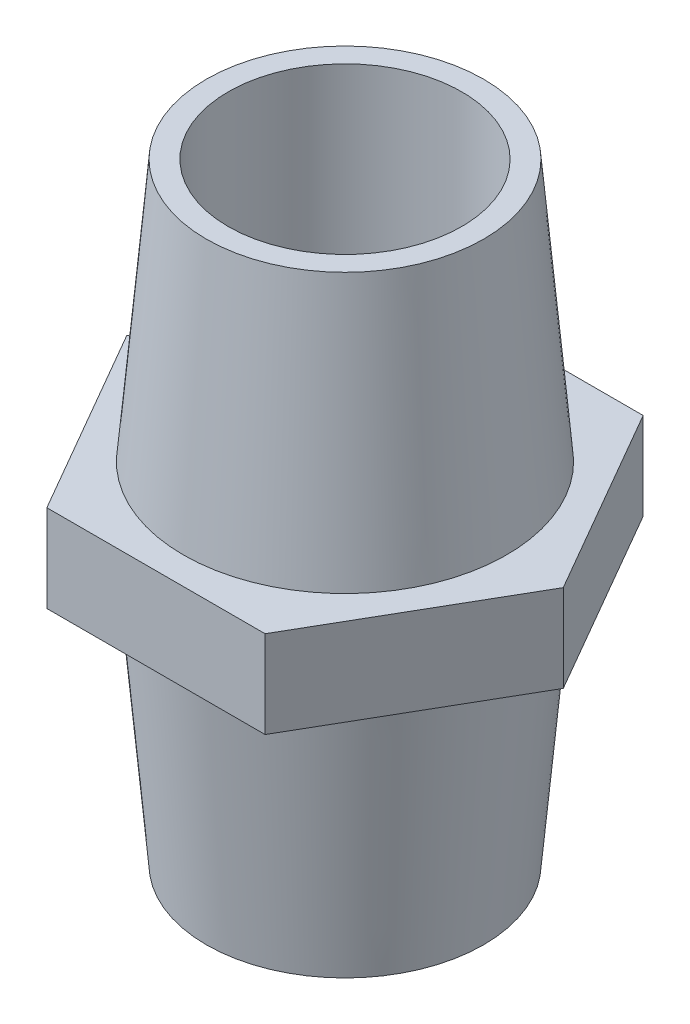
ISO-10303-21;
HEADER;
FILE_DESCRIPTION(('STEP AP214'),'2;1');
FILE_NAME('part.step','',(''),(''),'','','');
FILE_SCHEMA(('AUTOMOTIVE_DESIGN { 1 0 10303 214 1 1 1 1 }'));
ENDSEC;
DATA;
#1=APPLICATION_CONTEXT('core data for automotive mechanical design processes');
#2=APPLICATION_PROTOCOL_DEFINITION('international standard','automotive_design',2000,#1);
#3=PRODUCT_CONTEXT('',#1,'mechanical');
#4=PRODUCT('Part','Part','',(#3));
#5=PRODUCT_RELATED_PRODUCT_CATEGORY('part','',(#4));
#6=PRODUCT_DEFINITION_FORMATION('','',#4);
#7=PRODUCT_DEFINITION_CONTEXT('part definition',#1,'design');
#8=PRODUCT_DEFINITION('design','',#6,#7);
#9=PRODUCT_DEFINITION_SHAPE('','',#8);
#10=(LENGTH_UNIT() NAMED_UNIT(*) SI_UNIT(.MILLI.,.METRE.));
#11=(NAMED_UNIT(*) PLANE_ANGLE_UNIT() SI_UNIT($,.RADIAN.));
#12=(NAMED_UNIT(*) SI_UNIT($,.STERADIAN.) SOLID_ANGLE_UNIT());
#13=UNCERTAINTY_MEASURE_WITH_UNIT(LENGTH_MEASURE(1.E-05),#10,'distance_accuracy_value','');
#14=(GEOMETRIC_REPRESENTATION_CONTEXT(3) GLOBAL_UNCERTAINTY_ASSIGNED_CONTEXT((#13)) GLOBAL_UNIT_ASSIGNED_CONTEXT((#10,
#11,#12)) REPRESENTATION_CONTEXT('',''));
#15=CARTESIAN_POINT('',(0.,0.,0.));
#16=DIRECTION('',(0.,0.,1.));
#17=DIRECTION('',(1.,0.,0.));
#18=AXIS2_PLACEMENT_3D('',#15,#16,#17);
#19=CARTESIAN_POINT('',(11.11,0.,0.));
#20=DIRECTION('',(0.,1.,0.));
#21=DIRECTION('',(0.,0.,1.));
#22=AXIS2_PLACEMENT_3D('',#19,#20,#21);
#23=PLANE('',#22);
#24=CARTESIAN_POINT('',(0.,0.,0.));
#25=DIRECTION('',(0.,1.,0.));
#26=DIRECTION('',(0.,0.,1.));
#27=AXIS2_PLACEMENT_3D('',#24,#25,#26);
#28=CIRCLE('',#27,11.11);
#29=CARTESIAN_POINT('',(0.,0.,11.11));
#30=VERTEX_POINT('',#29);
#31=EDGE_CURVE('E41',#30,#30,#28,.T.);
#32=ORIENTED_EDGE('',*,*,#31,.T.);
#33=EDGE_LOOP('',(#32));
#34=FACE_BOUND('',#33,.T.);
#35=DIRECTION('',(0.499999999999995,0.,-0.866025403784442));
#36=VECTOR('',#35,1.);
#37=CARTESIAN_POINT('',(14.0275,0.,1.68441941036072));
#38=LINE('',#37,#36);
#39=CARTESIAN_POINT('',(7.50000000000015,0.,12.9903810567665));
#40=VERTEX_POINT('',#39);
#41=CARTESIAN_POINT('',(15.,0.,0.));
#42=VERTEX_POINT('',#41);
#43=EDGE_CURVE('E133',#40,#42,#38,.T.);
#44=ORIENTED_EDGE('',*,*,#43,.F.);
#45=DIRECTION('',(1.,0.,0.));
#46=VECTOR('',#45,1.);
#47=CARTESIAN_POINT('',(11.1100000000001,0.,12.9903810567665));
#48=LINE('',#47,#46);
#49=CARTESIAN_POINT('',(-7.49999999999988,0.,12.9903810567667));
#50=VERTEX_POINT('',#49);
#51=EDGE_CURVE('E131',#50,#40,#48,.T.);
#52=ORIENTED_EDGE('',*,*,#51,.F.);
#53=DIRECTION('',(0.500000000000007,0.,0.866025403784435));
#54=VECTOR('',#53,1.);
#55=CARTESIAN_POINT('',(-8.47249999999987,0.,11.305961646406));
#56=LINE('',#55,#54);
#57=CARTESIAN_POINT('',(-15.,0.,1.04744440165294E-13));
#58=VERTEX_POINT('',#57);
#59=EDGE_CURVE('E129',#58,#50,#56,.T.);
#60=ORIENTED_EDGE('',*,*,#59,.F.);
#61=DIRECTION('',(-0.499999999999995,0.,0.866025403784442));
#62=VECTOR('',#61,1.);
#63=CARTESIAN_POINT('',(-8.47250000000009,0.,-11.3059616464058));
#64=LINE('',#63,#62);
#65=CARTESIAN_POINT('',(-7.50000000000006,0.,-12.9903810567665));
#66=VERTEX_POINT('',#65);
#67=EDGE_CURVE('E127',#66,#58,#64,.T.);
#68=ORIENTED_EDGE('',*,*,#67,.F.);
#69=DIRECTION('',(-1.,0.,0.));
#70=VECTOR('',#69,1.);
#71=CARTESIAN_POINT('',(11.11,0.,-12.9903810567666));
#72=LINE('',#71,#70);
#73=CARTESIAN_POINT('',(7.49999999999997,0.,-12.9903810567666));
#74=VERTEX_POINT('',#73);
#75=EDGE_CURVE('E89',#74,#66,#72,.T.);
#76=ORIENTED_EDGE('',*,*,#75,.F.);
#77=DIRECTION('',(-0.500000000000001,0.,-0.866025403784438));
#78=VECTOR('',#77,1.);
#79=CARTESIAN_POINT('',(14.0275,0.,-1.68441941036074));
#80=LINE('',#79,#78);
#81=EDGE_CURVE('E119',#42,#74,#80,.T.);
#82=ORIENTED_EDGE('',*,*,#81,.F.);
#83=EDGE_LOOP('',(#44,#52,#60,#68,#76,#82));
#84=FACE_BOUND('',#83,.T.);
#85=ADVANCED_FACE('F33',(#34,#84),#23,.F.);
#86=CARTESIAN_POINT('',(15.,6.00000000000001,0.));
#87=DIRECTION('',(0.,-1.,0.));
#88=DIRECTION('',(0.,0.,-1.));
#89=AXIS2_PLACEMENT_3D('',#86,#87,#88);
#90=PLANE('',#89);
#91=CARTESIAN_POINT('',(0.,6.00000000000001,0.));
#92=DIRECTION('',(0.,1.,0.));
#93=DIRECTION('',(0.,0.,1.));
#94=AXIS2_PLACEMENT_3D('',#91,#92,#93);
#95=CIRCLE('',#94,11.11);
#96=CARTESIAN_POINT('',(0.,6.00000000000001,11.11));
#97=VERTEX_POINT('',#96);
#98=EDGE_CURVE('E144',#97,#97,#95,.T.);
#99=ORIENTED_EDGE('',*,*,#98,.F.);
#100=EDGE_LOOP('',(#99));
#101=FACE_BOUND('',#100,.T.);
#102=DIRECTION('',(0.499999999999995,0.,-0.866025403784441));
#103=VECTOR('',#102,1.);
#104=CARTESIAN_POINT('',(7.50000000000015,6.00000000000001,12.9903810567665));
#105=LINE('',#104,#103);
#106=CARTESIAN_POINT('',(7.50000000000015,6.00000000000001,12.9903810567665));
#107=VERTEX_POINT('',#106);
#108=CARTESIAN_POINT('',(15.,6.00000000000001,0.));
#109=VERTEX_POINT('',#108);
#110=EDGE_CURVE('E109',#107,#109,#105,.T.);
#111=ORIENTED_EDGE('',*,*,#110,.T.);
#112=DIRECTION('',(-0.500000000000001,0.,-0.866025403784438));
#113=VECTOR('',#112,1.);
#114=CARTESIAN_POINT('',(15.,6.00000000000001,0.));
#115=LINE('',#114,#113);
#116=CARTESIAN_POINT('',(7.49999999999998,6.00000000000001,-12.9903810567666));
#117=VERTEX_POINT('',#116);
#118=EDGE_CURVE('E107',#109,#117,#115,.T.);
#119=ORIENTED_EDGE('',*,*,#118,.T.);
#120=DIRECTION('',(-1.,0.,0.));
#121=VECTOR('',#120,1.);
#122=CARTESIAN_POINT('',(7.49999999999997,6.00000000000001,-12.9903810567666));
#123=LINE('',#122,#121);
#124=CARTESIAN_POINT('',(-7.50000000000006,6.00000000000001,-12.9903810567665));
#125=VERTEX_POINT('',#124);
#126=EDGE_CURVE('E56',#117,#125,#123,.T.);
#127=ORIENTED_EDGE('',*,*,#126,.T.);
#128=DIRECTION('',(-0.499999999999995,0.,0.866025403784442));
#129=VECTOR('',#128,1.);
#130=CARTESIAN_POINT('',(-7.50000000000006,6.00000000000001,-12.9903810567665));
#131=LINE('',#130,#129);
#132=CARTESIAN_POINT('',(-15.,6.00000000000001,1.04744440165294E-13));
#133=VERTEX_POINT('',#132);
#134=EDGE_CURVE('E96',#125,#133,#131,.T.);
#135=ORIENTED_EDGE('',*,*,#134,.T.);
#136=DIRECTION('',(0.500000000000007,0.,0.866025403784435));
#137=VECTOR('',#136,1.);
#138=CARTESIAN_POINT('',(-15.,6.00000000000001,1.04744440165294E-13));
#139=LINE('',#138,#137);
#140=CARTESIAN_POINT('',(-7.49999999999988,6.00000000000001,12.9903810567667));
#141=VERTEX_POINT('',#140);
#142=EDGE_CURVE('E102',#133,#141,#139,.T.);
#143=ORIENTED_EDGE('',*,*,#142,.T.);
#144=DIRECTION('',(1.,0.,0.));
#145=VECTOR('',#144,1.);
#146=CARTESIAN_POINT('',(-7.49999999999988,6.00000000000001,12.9903810567667));
#147=LINE('',#146,#145);
#148=EDGE_CURVE('E114',#141,#107,#147,.T.);
#149=ORIENTED_EDGE('',*,*,#148,.T.);
#150=EDGE_LOOP('',(#111,#119,#127,#135,#143,#149));
#151=FACE_BOUND('',#150,.T.);
#152=ADVANCED_FACE('F106',(#101,#151),#90,.F.);
#153=CARTESIAN_POINT('',(8.02500000000001,-18.,0.));
#154=DIRECTION('',(0.,1.,0.));
#155=DIRECTION('',(0.,0.,1.));
#156=AXIS2_PLACEMENT_3D('',#153,#154,#155);
#157=PLANE('',#156);
#158=CARTESIAN_POINT('',(0.,-18.,0.));
#159=DIRECTION('',(0.,1.,0.));
#160=DIRECTION('',(0.,0.,1.));
#161=AXIS2_PLACEMENT_3D('',#158,#159,#160);
#162=CIRCLE('',#161,9.52500000000001);
#163=CARTESIAN_POINT('',(0.,-18.,9.52500000000001));
#164=VERTEX_POINT('',#163);
#165=EDGE_CURVE('E12',#164,#164,#162,.T.);
#166=ORIENTED_EDGE('',*,*,#165,.F.);
#167=EDGE_LOOP('',(#166));
#168=FACE_BOUND('',#167,.T.);
#169=CARTESIAN_POINT('',(0.,-18.,0.));
#170=DIRECTION('',(0.,1.,0.));
#171=DIRECTION('',(0.,0.,1.));
#172=AXIS2_PLACEMENT_3D('',#169,#170,#171);
#173=CIRCLE('',#172,8.02500000000001);
#174=CARTESIAN_POINT('',(0.,-18.,8.02500000000001));
#175=VERTEX_POINT('',#174);
#176=EDGE_CURVE('E135',#175,#175,#173,.T.);
#177=ORIENTED_EDGE('',*,*,#176,.T.);
#178=EDGE_LOOP('',(#177));
#179=FACE_BOUND('',#178,.T.);
#180=ADVANCED_FACE('F35',(#168,#179),#157,.F.);
#181=CARTESIAN_POINT('',(0.,-18.,0.));
#182=DIRECTION('',(0.,1.,0.));
#183=DIRECTION('',(0.,0.,1.));
#184=AXIS2_PLACEMENT_3D('',#181,#182,#183);
#185=CONICAL_SURFACE('',#184,9.52500000000001,0.0878290206990912);
#186=ORIENTED_EDGE('',*,*,#31,.F.);
#187=EDGE_LOOP('',(#186));
#188=FACE_BOUND('',#187,.T.);
#189=ORIENTED_EDGE('',*,*,#165,.T.);
#190=EDGE_LOOP('',(#189));
#191=FACE_BOUND('',#190,.T.);
#192=ADVANCED_FACE('F151',(#188,#191),#185,.T.);
#193=CARTESIAN_POINT('',(0.,6.00000000000001,0.));
#194=DIRECTION('',(0.,-1.,0.));
#195=DIRECTION('',(0.,0.,-1.));
#196=AXIS2_PLACEMENT_3D('',#193,#194,#195);
#197=CONICAL_SURFACE('',#196,11.11,0.0878290206990916);
#198=CARTESIAN_POINT('',(0.,24.,0.));
#199=DIRECTION('',(0.,1.,0.));
#200=DIRECTION('',(0.,0.,1.));
#201=AXIS2_PLACEMENT_3D('',#198,#199,#200);
#202=CIRCLE('',#201,9.525);
#203=CARTESIAN_POINT('',(0.,24.,9.525));
#204=VERTEX_POINT('',#203);
#205=EDGE_CURVE('E141',#204,#204,#202,.T.);
#206=ORIENTED_EDGE('',*,*,#205,.F.);
#207=EDGE_LOOP('',(#206));
#208=FACE_BOUND('',#207,.T.);
#209=ORIENTED_EDGE('',*,*,#98,.T.);
#210=EDGE_LOOP('',(#209));
#211=FACE_BOUND('',#210,.T.);
#212=ADVANCED_FACE('F154',(#208,#211),#197,.T.);
#213=CARTESIAN_POINT('',(9.525,24.,0.));
#214=DIRECTION('',(0.,-1.,0.));
#215=DIRECTION('',(0.,0.,-1.));
#216=AXIS2_PLACEMENT_3D('',#213,#214,#215);
#217=PLANE('',#216);
#218=CARTESIAN_POINT('',(0.,24.,0.));
#219=DIRECTION('',(0.,1.,0.));
#220=DIRECTION('',(0.,0.,1.));
#221=AXIS2_PLACEMENT_3D('',#218,#219,#220);
#222=CIRCLE('',#221,8.025);
#223=CARTESIAN_POINT('',(0.,24.,8.025));
#224=VERTEX_POINT('',#223);
#225=EDGE_CURVE('E138',#224,#224,#222,.T.);
#226=ORIENTED_EDGE('',*,*,#225,.F.);
#227=EDGE_LOOP('',(#226));
#228=FACE_BOUND('',#227,.T.);
#229=ORIENTED_EDGE('',*,*,#205,.T.);
#230=EDGE_LOOP('',(#229));
#231=FACE_BOUND('',#230,.T.);
#232=ADVANCED_FACE('F165',(#228,#231),#217,.F.);
#233=CARTESIAN_POINT('',(0.,30.3344051122216,0.));
#234=DIRECTION('',(0.,1.,0.));
#235=DIRECTION('',(0.,0.,1.));
#236=AXIS2_PLACEMENT_3D('',#233,#234,#235);
#237=CYLINDRICAL_SURFACE('',#236,8.025);
#238=ORIENTED_EDGE('',*,*,#176,.F.);
#239=EDGE_LOOP('',(#238));
#240=FACE_BOUND('',#239,.T.);
#241=ORIENTED_EDGE('',*,*,#225,.T.);
#242=EDGE_LOOP('',(#241));
#243=FACE_BOUND('',#242,.T.);
#244=ADVANCED_FACE('F161',(#240,#243),#237,.F.);
#245=CARTESIAN_POINT('',(7.50000000000015,-18.,12.9903810567665));
#246=DIRECTION('',(0.866025403784442,0.,0.499999999999995));
#247=DIRECTION('',(0.499999999999995,0.,-0.866025403784442));
#248=AXIS2_PLACEMENT_3D('',#245,#246,#247);
#249=PLANE('',#248);
#250=ORIENTED_EDGE('',*,*,#43,.T.);
#251=DIRECTION('',(0.,1.,0.));
#252=VECTOR('',#251,1.);
#253=CARTESIAN_POINT('',(15.,-18.,0.));
#254=LINE('',#253,#252);
#255=EDGE_CURVE('E48',#42,#109,#254,.T.);
#256=ORIENTED_EDGE('',*,*,#255,.T.);
#257=ORIENTED_EDGE('',*,*,#110,.F.);
#258=DIRECTION('',(0.,1.,0.));
#259=VECTOR('',#258,1.);
#260=CARTESIAN_POINT('',(7.50000000000015,-18.,12.9903810567665));
#261=LINE('',#260,#259);
#262=EDGE_CURVE('E117',#40,#107,#261,.T.);
#263=ORIENTED_EDGE('',*,*,#262,.F.);
#264=EDGE_LOOP('',(#250,#256,#257,#263));
#265=FACE_BOUND('',#264,.T.);
#266=ADVANCED_FACE('F164',(#265),#249,.T.);
#267=CARTESIAN_POINT('',(-7.49999999999988,-18.,12.9903810567667));
#268=DIRECTION('',(0.,0.,1.));
#269=DIRECTION('',(1.,0.,0.));
#270=AXIS2_PLACEMENT_3D('',#267,#268,#269);
#271=PLANE('',#270);
#272=ORIENTED_EDGE('',*,*,#51,.T.);
#273=ORIENTED_EDGE('',*,*,#262,.T.);
#274=ORIENTED_EDGE('',*,*,#148,.F.);
#275=DIRECTION('',(0.,1.,0.));
#276=VECTOR('',#275,1.);
#277=CARTESIAN_POINT('',(-7.49999999999988,-18.,12.9903810567667));
#278=LINE('',#277,#276);
#279=EDGE_CURVE('E120',#50,#141,#278,.T.);
#280=ORIENTED_EDGE('',*,*,#279,.F.);
#281=EDGE_LOOP('',(#272,#273,#274,#280));
#282=FACE_BOUND('',#281,.T.);
#283=ADVANCED_FACE('F188',(#282),#271,.T.);
#284=CARTESIAN_POINT('',(-15.,-18.,1.04744440165294E-13));
#285=DIRECTION('',(-0.866025403784435,0.,0.500000000000007));
#286=DIRECTION('',(0.500000000000007,0.,0.866025403784435));
#287=AXIS2_PLACEMENT_3D('',#284,#285,#286);
#288=PLANE('',#287);
#289=ORIENTED_EDGE('',*,*,#59,.T.);
#290=ORIENTED_EDGE('',*,*,#279,.T.);
#291=ORIENTED_EDGE('',*,*,#142,.F.);
#292=DIRECTION('',(0.,1.,0.));
#293=VECTOR('',#292,1.);
#294=CARTESIAN_POINT('',(-15.,-18.,1.04744440165294E-13));
#295=LINE('',#294,#293);
#296=EDGE_CURVE('E92',#58,#133,#295,.T.);
#297=ORIENTED_EDGE('',*,*,#296,.F.);
#298=EDGE_LOOP('',(#289,#290,#291,#297));
#299=FACE_BOUND('',#298,.T.);
#300=ADVANCED_FACE('F197',(#299),#288,.T.);
#301=CARTESIAN_POINT('',(-7.50000000000006,-18.,-12.9903810567665));
#302=DIRECTION('',(-0.866025403784442,0.,-0.499999999999995));
#303=DIRECTION('',(-0.499999999999995,0.,0.866025403784442));
#304=AXIS2_PLACEMENT_3D('',#301,#302,#303);
#305=PLANE('',#304);
#306=ORIENTED_EDGE('',*,*,#67,.T.);
#307=ORIENTED_EDGE('',*,*,#296,.T.);
#308=ORIENTED_EDGE('',*,*,#134,.F.);
#309=DIRECTION('',(0.,1.,0.));
#310=VECTOR('',#309,1.);
#311=CARTESIAN_POINT('',(-7.50000000000006,-18.,-12.9903810567665));
#312=LINE('',#311,#310);
#313=EDGE_CURVE('E85',#66,#125,#312,.T.);
#314=ORIENTED_EDGE('',*,*,#313,.F.);
#315=EDGE_LOOP('',(#306,#307,#308,#314));
#316=FACE_BOUND('',#315,.T.);
#317=ADVANCED_FACE('F97',(#316),#305,.T.);
#318=CARTESIAN_POINT('',(7.49999999999997,-18.,-12.9903810567666));
#319=DIRECTION('',(0.,0.,-1.));
#320=DIRECTION('',(-1.,0.,0.));
#321=AXIS2_PLACEMENT_3D('',#318,#319,#320);
#322=PLANE('',#321);
#323=ORIENTED_EDGE('',*,*,#75,.T.);
#324=ORIENTED_EDGE('',*,*,#313,.T.);
#325=ORIENTED_EDGE('',*,*,#126,.F.);
#326=DIRECTION('',(0.,1.,0.));
#327=VECTOR('',#326,1.);
#328=CARTESIAN_POINT('',(7.49999999999997,-18.,-12.9903810567666));
#329=LINE('',#328,#327);
#330=EDGE_CURVE('E93',#74,#117,#329,.T.);
#331=ORIENTED_EDGE('',*,*,#330,.F.);
#332=EDGE_LOOP('',(#323,#324,#325,#331));
#333=FACE_BOUND('',#332,.T.);
#334=ADVANCED_FACE('F87',(#333),#322,.T.);
#335=CARTESIAN_POINT('',(15.,-18.,0.));
#336=DIRECTION('',(0.866025403784438,0.,-0.500000000000001));
#337=DIRECTION('',(-0.500000000000001,0.,-0.866025403784438));
#338=AXIS2_PLACEMENT_3D('',#335,#336,#337);
#339=PLANE('',#338);
#340=ORIENTED_EDGE('',*,*,#81,.T.);
#341=ORIENTED_EDGE('',*,*,#330,.T.);
#342=ORIENTED_EDGE('',*,*,#118,.F.);
#343=ORIENTED_EDGE('',*,*,#255,.F.);
#344=EDGE_LOOP('',(#340,#341,#342,#343));
#345=FACE_BOUND('',#344,.T.);
#346=ADVANCED_FACE('F190',(#345),#339,.T.);
#347=CLOSED_SHELL('',(#85,#152,#180,#192,#212,#232,#244,#266,#283,#300,#317,#334,#346));
#348=MANIFOLD_SOLID_BREP('B2',#347);
#349=ADVANCED_BREP_SHAPE_REPRESENTATION('',(#18,#348),#14);
#350=SHAPE_DEFINITION_REPRESENTATION(#9,#349);
ENDSEC;
END-ISO-10303-21;
